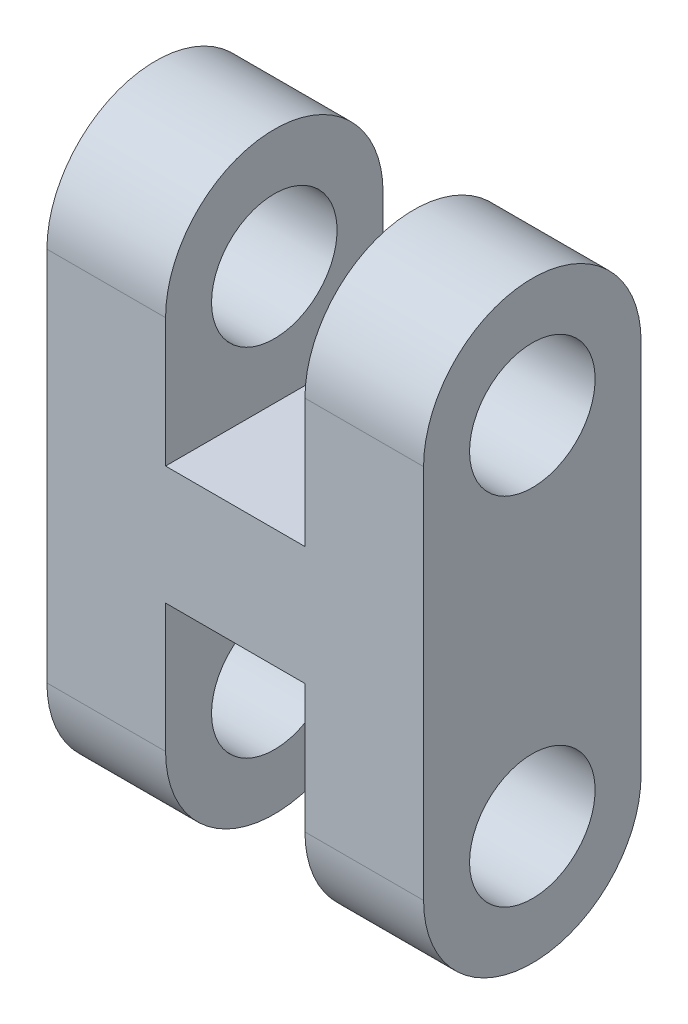
ISO-10303-21;
HEADER;
FILE_DESCRIPTION(('STEP AP214'),'2;1');
FILE_NAME('part.step','',(''),(''),'','','');
FILE_SCHEMA(('AUTOMOTIVE_DESIGN { 1 0 10303 214 1 1 1 1 }'));
ENDSEC;
DATA;
#1=APPLICATION_CONTEXT('core data for automotive mechanical design processes');
#2=APPLICATION_PROTOCOL_DEFINITION('international standard','automotive_design',2000,#1);
#3=PRODUCT_CONTEXT('',#1,'mechanical');
#4=PRODUCT('Part','Part','',(#3));
#5=PRODUCT_RELATED_PRODUCT_CATEGORY('part','',(#4));
#6=PRODUCT_DEFINITION_FORMATION('','',#4);
#7=PRODUCT_DEFINITION_CONTEXT('part definition',#1,'design');
#8=PRODUCT_DEFINITION('design','',#6,#7);
#9=PRODUCT_DEFINITION_SHAPE('','',#8);
#10=(LENGTH_UNIT() NAMED_UNIT(*) SI_UNIT(.MILLI.,.METRE.));
#11=(NAMED_UNIT(*) PLANE_ANGLE_UNIT() SI_UNIT($,.RADIAN.));
#12=(NAMED_UNIT(*) SI_UNIT($,.STERADIAN.) SOLID_ANGLE_UNIT());
#13=UNCERTAINTY_MEASURE_WITH_UNIT(LENGTH_MEASURE(1.E-05),#10,'distance_accuracy_value','');
#14=(GEOMETRIC_REPRESENTATION_CONTEXT(3) GLOBAL_UNCERTAINTY_ASSIGNED_CONTEXT((#13)) GLOBAL_UNIT_ASSIGNED_CONTEXT((#10,
#11,#12)) REPRESENTATION_CONTEXT('',''));
#15=CARTESIAN_POINT('',(0.,0.,0.));
#16=DIRECTION('',(0.,0.,1.));
#17=DIRECTION('',(1.,0.,0.));
#18=AXIS2_PLACEMENT_3D('',#15,#16,#17);
#19=CARTESIAN_POINT('',(6.525,0.,5.5));
#20=DIRECTION('',(-1.,0.,0.));
#21=DIRECTION('',(0.,0.,1.));
#22=AXIS2_PLACEMENT_3D('',#19,#20,#21);
#23=PLANE('',#22);
#24=CARTESIAN_POINT('',(6.525,12.,2.75));
#25=DIRECTION('',(-1.,0.,0.));
#26=DIRECTION('',(0.,0.,1.));
#27=AXIS2_PLACEMENT_3D('',#24,#25,#26);
#28=CIRCLE('',#27,1.5875);
#29=CARTESIAN_POINT('',(6.525,12.,4.3375));
#30=VERTEX_POINT('',#29);
#31=EDGE_CURVE('E248',#30,#30,#28,.F.);
#32=ORIENTED_EDGE('',*,*,#31,.F.);
#33=EDGE_LOOP('',(#32));
#34=FACE_BOUND('',#33,.T.);
#35=CARTESIAN_POINT('',(6.525,3.,2.75));
#36=DIRECTION('',(-1.,0.,0.));
#37=DIRECTION('',(0.,0.,1.));
#38=AXIS2_PLACEMENT_3D('',#35,#36,#37);
#39=CIRCLE('',#38,1.5875);
#40=CARTESIAN_POINT('',(6.525,3.,4.3375));
#41=VERTEX_POINT('',#40);
#42=EDGE_CURVE('E251',#41,#41,#39,.T.);
#43=ORIENTED_EDGE('',*,*,#42,.T.);
#44=EDGE_LOOP('',(#43));
#45=FACE_BOUND('',#44,.T.);
#46=CARTESIAN_POINT('',(6.525,2.75,2.75));
#47=DIRECTION('',(-1.,0.,0.));
#48=DIRECTION('',(0.,0.,1.));
#49=AXIS2_PLACEMENT_3D('',#46,#47,#48);
#50=CIRCLE('',#49,2.75);
#51=CARTESIAN_POINT('',(6.525,2.75,5.5));
#52=VERTEX_POINT('',#51);
#53=CARTESIAN_POINT('',(6.525,2.75,0.));
#54=VERTEX_POINT('',#53);
#55=EDGE_CURVE('E188',#52,#54,#50,.F.);
#56=ORIENTED_EDGE('',*,*,#55,.T.);
#57=DIRECTION('',(0.,1.,0.));
#58=VECTOR('',#57,1.);
#59=CARTESIAN_POINT('',(6.525,0.,0.));
#60=LINE('',#59,#58);
#61=CARTESIAN_POINT('',(6.525,12.25,0.));
#62=VERTEX_POINT('',#61);
#63=EDGE_CURVE('E115',#54,#62,#60,.T.);
#64=ORIENTED_EDGE('',*,*,#63,.T.);
#65=CARTESIAN_POINT('',(6.525,12.25,2.75));
#66=DIRECTION('',(-1.,0.,0.));
#67=DIRECTION('',(0.,0.,1.));
#68=AXIS2_PLACEMENT_3D('',#65,#66,#67);
#69=CIRCLE('',#68,2.75);
#70=CARTESIAN_POINT('',(6.525,12.25,5.5));
#71=VERTEX_POINT('',#70);
#72=EDGE_CURVE('E275',#62,#71,#69,.F.);
#73=ORIENTED_EDGE('',*,*,#72,.T.);
#74=DIRECTION('',(0.,1.,0.));
#75=VECTOR('',#74,1.);
#76=CARTESIAN_POINT('',(6.525,0.,5.5));
#77=LINE('',#76,#75);
#78=EDGE_CURVE('E190',#52,#71,#77,.T.);
#79=ORIENTED_EDGE('',*,*,#78,.F.);
#80=EDGE_LOOP('',(#56,#64,#73,#79));
#81=FACE_BOUND('',#80,.T.);
#82=ADVANCED_FACE('F100',(#34,#45,#81),#23,.F.);
#83=CARTESIAN_POINT('',(-3.,0.,5.5));
#84=DIRECTION('',(1.,0.,0.));
#85=DIRECTION('',(0.,1.,0.));
#86=AXIS2_PLACEMENT_3D('',#83,#84,#85);
#87=PLANE('',#86);
#88=CARTESIAN_POINT('',(-3.,12.,2.75));
#89=DIRECTION('',(-1.,0.,0.));
#90=DIRECTION('',(0.,0.,1.));
#91=AXIS2_PLACEMENT_3D('',#88,#89,#90);
#92=CIRCLE('',#91,1.5875);
#93=CARTESIAN_POINT('',(-3.,12.,4.3375));
#94=VERTEX_POINT('',#93);
#95=EDGE_CURVE('E262',#94,#94,#92,.T.);
#96=ORIENTED_EDGE('',*,*,#95,.F.);
#97=EDGE_LOOP('',(#96));
#98=FACE_BOUND('',#97,.T.);
#99=CARTESIAN_POINT('',(-3.,3.,2.75));
#100=DIRECTION('',(-1.,0.,0.));
#101=DIRECTION('',(0.,0.,1.));
#102=AXIS2_PLACEMENT_3D('',#99,#100,#101);
#103=CIRCLE('',#102,1.5875);
#104=CARTESIAN_POINT('',(-3.,3.,4.3375));
#105=VERTEX_POINT('',#104);
#106=EDGE_CURVE('E244',#105,#105,#103,.F.);
#107=ORIENTED_EDGE('',*,*,#106,.T.);
#108=EDGE_LOOP('',(#107));
#109=FACE_BOUND('',#108,.T.);
#110=DIRECTION('',(0.,-1.,0.));
#111=VECTOR('',#110,1.);
#112=CARTESIAN_POINT('',(-3.,0.,0.));
#113=LINE('',#112,#111);
#114=CARTESIAN_POINT('',(-3.,12.25,0.));
#115=VERTEX_POINT('',#114);
#116=CARTESIAN_POINT('',(-3.,2.75,0.));
#117=VERTEX_POINT('',#116);
#118=EDGE_CURVE('E222',#115,#117,#113,.T.);
#119=ORIENTED_EDGE('',*,*,#118,.T.);
#120=CARTESIAN_POINT('',(-3.,2.75,2.75));
#121=DIRECTION('',(-1.,0.,0.));
#122=DIRECTION('',(0.,0.,1.));
#123=AXIS2_PLACEMENT_3D('',#120,#121,#122);
#124=CIRCLE('',#123,2.75);
#125=CARTESIAN_POINT('',(-3.,2.75,5.5));
#126=VERTEX_POINT('',#125);
#127=EDGE_CURVE('E322',#117,#126,#124,.T.);
#128=ORIENTED_EDGE('',*,*,#127,.T.);
#129=DIRECTION('',(0.,-1.,0.));
#130=VECTOR('',#129,1.);
#131=CARTESIAN_POINT('',(-3.,0.,5.5));
#132=LINE('',#131,#130);
#133=CARTESIAN_POINT('',(-3.,12.25,5.5));
#134=VERTEX_POINT('',#133);
#135=EDGE_CURVE('E230',#134,#126,#132,.T.);
#136=ORIENTED_EDGE('',*,*,#135,.F.);
#137=CARTESIAN_POINT('',(-3.,12.25,2.75));
#138=DIRECTION('',(-1.,0.,0.));
#139=DIRECTION('',(0.,0.,1.));
#140=AXIS2_PLACEMENT_3D('',#137,#138,#139);
#141=CIRCLE('',#140,2.75);
#142=EDGE_CURVE('E274',#134,#115,#141,.T.);
#143=ORIENTED_EDGE('',*,*,#142,.T.);
#144=EDGE_LOOP('',(#119,#128,#136,#143));
#145=FACE_BOUND('',#144,.T.);
#146=ADVANCED_FACE('F320',(#98,#109,#145),#87,.F.);
#147=CARTESIAN_POINT('',(0.,0.,5.5));
#148=DIRECTION('',(-1.,0.,0.));
#149=DIRECTION('',(0.,0.,1.));
#150=AXIS2_PLACEMENT_3D('',#147,#148,#149);
#151=PLANE('',#150);
#152=CARTESIAN_POINT('',(0.,3.,2.75));
#153=DIRECTION('',(-1.,0.,0.));
#154=DIRECTION('',(0.,0.,1.));
#155=AXIS2_PLACEMENT_3D('',#152,#153,#154);
#156=CIRCLE('',#155,1.5875);
#157=CARTESIAN_POINT('',(0.,3.,4.3375));
#158=VERTEX_POINT('',#157);
#159=EDGE_CURVE('E243',#158,#158,#156,.F.);
#160=ORIENTED_EDGE('',*,*,#159,.F.);
#161=EDGE_LOOP('',(#160));
#162=FACE_BOUND('',#161,.T.);
#163=CARTESIAN_POINT('',(0.,2.75,2.75));
#164=DIRECTION('',(-1.,0.,0.));
#165=DIRECTION('',(0.,0.,1.));
#166=AXIS2_PLACEMENT_3D('',#163,#164,#165);
#167=CIRCLE('',#166,2.75);
#168=CARTESIAN_POINT('',(0.,2.75,0.));
#169=VERTEX_POINT('',#168);
#170=CARTESIAN_POINT('',(0.,2.75,5.5));
#171=VERTEX_POINT('',#170);
#172=EDGE_CURVE('E256',#169,#171,#167,.T.);
#173=ORIENTED_EDGE('',*,*,#172,.F.);
#174=DIRECTION('',(0.,1.,0.));
#175=VECTOR('',#174,1.);
#176=CARTESIAN_POINT('',(0.,0.,0.));
#177=LINE('',#176,#175);
#178=CARTESIAN_POINT('',(0.,6.,0.));
#179=VERTEX_POINT('',#178);
#180=EDGE_CURVE('E283',#169,#179,#177,.T.);
#181=ORIENTED_EDGE('',*,*,#180,.T.);
#182=DIRECTION('',(0.,0.,-1.));
#183=VECTOR('',#182,1.);
#184=CARTESIAN_POINT('',(0.,6.,5.5));
#185=LINE('',#184,#183);
#186=CARTESIAN_POINT('',(0.,6.,5.5));
#187=VERTEX_POINT('',#186);
#188=EDGE_CURVE('E236',#187,#179,#185,.T.);
#189=ORIENTED_EDGE('',*,*,#188,.F.);
#190=DIRECTION('',(0.,1.,0.));
#191=VECTOR('',#190,1.);
#192=CARTESIAN_POINT('',(0.,0.,5.5));
#193=LINE('',#192,#191);
#194=EDGE_CURVE('E225',#171,#187,#193,.T.);
#195=ORIENTED_EDGE('',*,*,#194,.F.);
#196=EDGE_LOOP('',(#173,#181,#189,#195));
#197=FACE_BOUND('',#196,.T.);
#198=ADVANCED_FACE('F102',(#162,#197),#151,.F.);
#199=CARTESIAN_POINT('',(3.525,0.,5.5));
#200=DIRECTION('',(1.,0.,0.));
#201=DIRECTION('',(0.,0.,-1.));
#202=AXIS2_PLACEMENT_3D('',#199,#200,#201);
#203=PLANE('',#202);
#204=CARTESIAN_POINT('',(3.525,3.,2.75));
#205=DIRECTION('',(1.,0.,0.));
#206=DIRECTION('',(0.,0.,-1.));
#207=AXIS2_PLACEMENT_3D('',#204,#205,#206);
#208=CIRCLE('',#207,1.5875);
#209=CARTESIAN_POINT('',(3.525,3.,1.1625));
#210=VERTEX_POINT('',#209);
#211=EDGE_CURVE('E241',#210,#210,#208,.F.);
#212=ORIENTED_EDGE('',*,*,#211,.F.);
#213=EDGE_LOOP('',(#212));
#214=FACE_BOUND('',#213,.T.);
#215=DIRECTION('',(0.,-1.,0.));
#216=VECTOR('',#215,1.);
#217=CARTESIAN_POINT('',(3.525,0.,0.));
#218=LINE('',#217,#216);
#219=CARTESIAN_POINT('',(3.525,6.,0.));
#220=VERTEX_POINT('',#219);
#221=CARTESIAN_POINT('',(3.525,2.75,0.));
#222=VERTEX_POINT('',#221);
#223=EDGE_CURVE('E210',#220,#222,#218,.T.);
#224=ORIENTED_EDGE('',*,*,#223,.T.);
#225=CARTESIAN_POINT('',(3.525,2.75,2.75));
#226=DIRECTION('',(1.,0.,0.));
#227=DIRECTION('',(0.,0.,-1.));
#228=AXIS2_PLACEMENT_3D('',#225,#226,#227);
#229=CIRCLE('',#228,2.75);
#230=CARTESIAN_POINT('',(3.525,2.75,5.5));
#231=VERTEX_POINT('',#230);
#232=EDGE_CURVE('E199',#231,#222,#229,.T.);
#233=ORIENTED_EDGE('',*,*,#232,.F.);
#234=DIRECTION('',(0.,-1.,0.));
#235=VECTOR('',#234,1.);
#236=CARTESIAN_POINT('',(3.525,0.,5.5));
#237=LINE('',#236,#235);
#238=CARTESIAN_POINT('',(3.525,6.,5.5));
#239=VERTEX_POINT('',#238);
#240=EDGE_CURVE('E287',#239,#231,#237,.T.);
#241=ORIENTED_EDGE('',*,*,#240,.F.);
#242=DIRECTION('',(0.,0.,-1.));
#243=VECTOR('',#242,1.);
#244=CARTESIAN_POINT('',(3.525,6.,5.5));
#245=LINE('',#244,#243);
#246=EDGE_CURVE('E233',#239,#220,#245,.T.);
#247=ORIENTED_EDGE('',*,*,#246,.T.);
#248=EDGE_LOOP('',(#224,#233,#241,#247));
#249=FACE_BOUND('',#248,.T.);
#250=ADVANCED_FACE('F309',(#214,#249),#203,.F.);
#251=CARTESIAN_POINT('',(0.,0.,5.5));
#252=DIRECTION('',(0.,0.,-1.));
#253=DIRECTION('',(-1.,0.,0.));
#254=AXIS2_PLACEMENT_3D('',#251,#252,#253);
#255=PLANE('',#254);
#256=DIRECTION('',(-1.,0.,0.));
#257=VECTOR('',#256,1.);
#258=CARTESIAN_POINT('',(11.0151280605346,2.75,5.5));
#259=LINE('',#258,#257);
#260=EDGE_CURVE('E312',#52,#231,#259,.T.);
#261=ORIENTED_EDGE('',*,*,#260,.F.);
#262=ORIENTED_EDGE('',*,*,#78,.T.);
#263=DIRECTION('',(-1.,0.,0.));
#264=VECTOR('',#263,1.);
#265=CARTESIAN_POINT('',(11.0151280605346,12.25,5.5));
#266=LINE('',#265,#264);
#267=CARTESIAN_POINT('',(3.525,12.25,5.5));
#268=VERTEX_POINT('',#267);
#269=EDGE_CURVE('E271',#71,#268,#266,.T.);
#270=ORIENTED_EDGE('',*,*,#269,.T.);
#271=DIRECTION('',(0.,-1.,0.));
#272=VECTOR('',#271,1.);
#273=CARTESIAN_POINT('',(3.525,9.,5.5));
#274=LINE('',#273,#272);
#275=CARTESIAN_POINT('',(3.525,9.,5.5));
#276=VERTEX_POINT('',#275);
#277=EDGE_CURVE('E291',#268,#276,#274,.T.);
#278=ORIENTED_EDGE('',*,*,#277,.T.);
#279=DIRECTION('',(-1.,0.,0.));
#280=VECTOR('',#279,1.);
#281=CARTESIAN_POINT('',(0.,9.,5.5));
#282=LINE('',#281,#280);
#283=CARTESIAN_POINT('',(0.,9.,5.5));
#284=VERTEX_POINT('',#283);
#285=EDGE_CURVE('E293',#276,#284,#282,.T.);
#286=ORIENTED_EDGE('',*,*,#285,.T.);
#287=DIRECTION('',(0.,1.,0.));
#288=VECTOR('',#287,1.);
#289=CARTESIAN_POINT('',(0.,15.,5.5));
#290=LINE('',#289,#288);
#291=CARTESIAN_POINT('',(0.,12.25,5.5));
#292=VERTEX_POINT('',#291);
#293=EDGE_CURVE('E295',#284,#292,#290,.T.);
#294=ORIENTED_EDGE('',*,*,#293,.T.);
#295=DIRECTION('',(-1.,0.,0.));
#296=VECTOR('',#295,1.);
#297=CARTESIAN_POINT('',(11.0151280605346,12.25,5.5));
#298=LINE('',#297,#296);
#299=EDGE_CURVE('E108',#134,#292,#298,.F.);
#300=ORIENTED_EDGE('',*,*,#299,.F.);
#301=ORIENTED_EDGE('',*,*,#135,.T.);
#302=EDGE_CURVE('E193',#171,#126,#259,.T.);
#303=ORIENTED_EDGE('',*,*,#302,.F.);
#304=ORIENTED_EDGE('',*,*,#194,.T.);
#305=DIRECTION('',(1.,0.,0.));
#306=VECTOR('',#305,1.);
#307=CARTESIAN_POINT('',(0.,6.,5.5));
#308=LINE('',#307,#306);
#309=EDGE_CURVE('E285',#187,#239,#308,.T.);
#310=ORIENTED_EDGE('',*,*,#309,.T.);
#311=ORIENTED_EDGE('',*,*,#240,.T.);
#312=EDGE_LOOP('',(#261,#262,#270,#278,#286,#294,#300,#301,#303,#304,#310,#311));
#313=FACE_BOUND('',#312,.T.);
#314=ADVANCED_FACE('F311',(#313),#255,.F.);
#315=CARTESIAN_POINT('',(3.525,9.,5.5));
#316=DIRECTION('',(1.,0.,0.));
#317=DIRECTION('',(0.,0.,-1.));
#318=AXIS2_PLACEMENT_3D('',#315,#316,#317);
#319=PLANE('',#318);
#320=CARTESIAN_POINT('',(3.525,12.,2.75));
#321=DIRECTION('',(1.,0.,0.));
#322=DIRECTION('',(0.,0.,-1.));
#323=AXIS2_PLACEMENT_3D('',#320,#321,#322);
#324=CIRCLE('',#323,1.5875);
#325=CARTESIAN_POINT('',(3.525,12.,1.1625));
#326=VERTEX_POINT('',#325);
#327=EDGE_CURVE('E268',#326,#326,#324,.T.);
#328=ORIENTED_EDGE('',*,*,#327,.T.);
#329=EDGE_LOOP('',(#328));
#330=FACE_BOUND('',#329,.T.);
#331=ORIENTED_EDGE('',*,*,#277,.F.);
#332=CARTESIAN_POINT('',(3.525,12.25,2.75));
#333=DIRECTION('',(1.,0.,0.));
#334=DIRECTION('',(0.,0.,-1.));
#335=AXIS2_PLACEMENT_3D('',#332,#333,#334);
#336=CIRCLE('',#335,2.75);
#337=CARTESIAN_POINT('',(3.525,12.25,0.));
#338=VERTEX_POINT('',#337);
#339=EDGE_CURVE('E281',#338,#268,#336,.T.);
#340=ORIENTED_EDGE('',*,*,#339,.F.);
#341=DIRECTION('',(0.,-1.,0.));
#342=VECTOR('',#341,1.);
#343=CARTESIAN_POINT('',(3.525,9.,0.));
#344=LINE('',#343,#342);
#345=CARTESIAN_POINT('',(3.525,9.,0.));
#346=VERTEX_POINT('',#345);
#347=EDGE_CURVE('E209',#338,#346,#344,.T.);
#348=ORIENTED_EDGE('',*,*,#347,.T.);
#349=DIRECTION('',(0.,0.,-1.));
#350=VECTOR('',#349,1.);
#351=CARTESIAN_POINT('',(3.525,9.,5.5));
#352=LINE('',#351,#350);
#353=EDGE_CURVE('E229',#276,#346,#352,.T.);
#354=ORIENTED_EDGE('',*,*,#353,.F.);
#355=EDGE_LOOP('',(#331,#340,#348,#354));
#356=FACE_BOUND('',#355,.T.);
#357=ADVANCED_FACE('F337',(#330,#356),#319,.F.);
#358=CARTESIAN_POINT('',(0.,15.,5.5));
#359=DIRECTION('',(-1.,0.,0.));
#360=DIRECTION('',(0.,0.,1.));
#361=AXIS2_PLACEMENT_3D('',#358,#359,#360);
#362=PLANE('',#361);
#363=CARTESIAN_POINT('',(0.,12.,2.75));
#364=DIRECTION('',(-1.,0.,0.));
#365=DIRECTION('',(0.,0.,1.));
#366=AXIS2_PLACEMENT_3D('',#363,#364,#365);
#367=CIRCLE('',#366,1.5875);
#368=CARTESIAN_POINT('',(0.,12.,4.3375));
#369=VERTEX_POINT('',#368);
#370=EDGE_CURVE('E265',#369,#369,#367,.T.);
#371=ORIENTED_EDGE('',*,*,#370,.T.);
#372=EDGE_LOOP('',(#371));
#373=FACE_BOUND('',#372,.T.);
#374=CARTESIAN_POINT('',(0.,12.25,2.75));
#375=DIRECTION('',(-1.,0.,0.));
#376=DIRECTION('',(0.,0.,1.));
#377=AXIS2_PLACEMENT_3D('',#374,#375,#376);
#378=CIRCLE('',#377,2.75);
#379=CARTESIAN_POINT('',(0.,12.25,0.));
#380=VERTEX_POINT('',#379);
#381=EDGE_CURVE('E123',#292,#380,#378,.T.);
#382=ORIENTED_EDGE('',*,*,#381,.F.);
#383=ORIENTED_EDGE('',*,*,#293,.F.);
#384=DIRECTION('',(0.,0.,-1.));
#385=VECTOR('',#384,1.);
#386=CARTESIAN_POINT('',(0.,9.,5.5));
#387=LINE('',#386,#385);
#388=CARTESIAN_POINT('',(0.,9.,0.));
#389=VERTEX_POINT('',#388);
#390=EDGE_CURVE('E226',#284,#389,#387,.T.);
#391=ORIENTED_EDGE('',*,*,#390,.T.);
#392=DIRECTION('',(0.,1.,0.));
#393=VECTOR('',#392,1.);
#394=CARTESIAN_POINT('',(0.,15.,0.));
#395=LINE('',#394,#393);
#396=EDGE_CURVE('E219',#389,#380,#395,.T.);
#397=ORIENTED_EDGE('',*,*,#396,.T.);
#398=EDGE_LOOP('',(#382,#383,#391,#397));
#399=FACE_BOUND('',#398,.T.);
#400=ADVANCED_FACE('F329',(#373,#399),#362,.F.);
#401=CARTESIAN_POINT('',(0.,6.,5.5));
#402=DIRECTION('',(0.,1.,0.));
#403=DIRECTION('',(0.,0.,1.));
#404=AXIS2_PLACEMENT_3D('',#401,#402,#403);
#405=PLANE('',#404);
#406=DIRECTION('',(1.,0.,0.));
#407=VECTOR('',#406,1.);
#408=CARTESIAN_POINT('',(0.,6.,0.));
#409=LINE('',#408,#407);
#410=EDGE_CURVE('E214',#179,#220,#409,.T.);
#411=ORIENTED_EDGE('',*,*,#410,.T.);
#412=ORIENTED_EDGE('',*,*,#246,.F.);
#413=ORIENTED_EDGE('',*,*,#309,.F.);
#414=ORIENTED_EDGE('',*,*,#188,.T.);
#415=EDGE_LOOP('',(#411,#412,#413,#414));
#416=FACE_BOUND('',#415,.T.);
#417=ADVANCED_FACE('F303',(#416),#405,.F.);
#418=CARTESIAN_POINT('',(0.,9.,5.5));
#419=DIRECTION('',(0.,-1.,0.));
#420=DIRECTION('',(0.,0.,-1.));
#421=AXIS2_PLACEMENT_3D('',#418,#419,#420);
#422=PLANE('',#421);
#423=DIRECTION('',(-1.,0.,0.));
#424=VECTOR('',#423,1.);
#425=CARTESIAN_POINT('',(0.,9.,0.));
#426=LINE('',#425,#424);
#427=EDGE_CURVE('E212',#346,#389,#426,.T.);
#428=ORIENTED_EDGE('',*,*,#427,.T.);
#429=ORIENTED_EDGE('',*,*,#390,.F.);
#430=ORIENTED_EDGE('',*,*,#285,.F.);
#431=ORIENTED_EDGE('',*,*,#353,.T.);
#432=EDGE_LOOP('',(#428,#429,#430,#431));
#433=FACE_BOUND('',#432,.T.);
#434=ADVANCED_FACE('F333',(#433),#422,.F.);
#435=CARTESIAN_POINT('',(0.,0.,0.));
#436=DIRECTION('',(0.,0.,-1.));
#437=DIRECTION('',(-1.,0.,0.));
#438=AXIS2_PLACEMENT_3D('',#435,#436,#437);
#439=PLANE('',#438);
#440=DIRECTION('',(-1.,0.,0.));
#441=VECTOR('',#440,1.);
#442=CARTESIAN_POINT('',(11.0151280605346,2.75,0.));
#443=LINE('',#442,#441);
#444=EDGE_CURVE('E12',#117,#169,#443,.F.);
#445=ORIENTED_EDGE('',*,*,#444,.F.);
#446=ORIENTED_EDGE('',*,*,#118,.F.);
#447=DIRECTION('',(-1.,0.,0.));
#448=VECTOR('',#447,1.);
#449=CARTESIAN_POINT('',(11.0151280605346,12.25,0.));
#450=LINE('',#449,#448);
#451=EDGE_CURVE('E239',#380,#115,#450,.T.);
#452=ORIENTED_EDGE('',*,*,#451,.F.);
#453=ORIENTED_EDGE('',*,*,#396,.F.);
#454=ORIENTED_EDGE('',*,*,#427,.F.);
#455=ORIENTED_EDGE('',*,*,#347,.F.);
#456=DIRECTION('',(-1.,0.,0.));
#457=VECTOR('',#456,1.);
#458=CARTESIAN_POINT('',(11.0151280605346,12.25,0.));
#459=LINE('',#458,#457);
#460=EDGE_CURVE('E208',#62,#338,#459,.T.);
#461=ORIENTED_EDGE('',*,*,#460,.F.);
#462=ORIENTED_EDGE('',*,*,#63,.F.);
#463=DIRECTION('',(-1.,0.,0.));
#464=VECTOR('',#463,1.);
#465=CARTESIAN_POINT('',(11.0151280605346,2.75,0.));
#466=LINE('',#465,#464);
#467=EDGE_CURVE('E194',#54,#222,#466,.T.);
#468=ORIENTED_EDGE('',*,*,#467,.T.);
#469=ORIENTED_EDGE('',*,*,#223,.F.);
#470=ORIENTED_EDGE('',*,*,#410,.F.);
#471=ORIENTED_EDGE('',*,*,#180,.F.);
#472=EDGE_LOOP('',(#445,#446,#452,#453,#454,#455,#461,#462,#468,#469,#470,#471));
#473=FACE_BOUND('',#472,.T.);
#474=ADVANCED_FACE('F206',(#473),#439,.T.);
#475=CARTESIAN_POINT('',(11.0151280605346,12.25,2.75));
#476=DIRECTION('',(-1.,0.,0.));
#477=DIRECTION('',(0.,0.,1.));
#478=AXIS2_PLACEMENT_3D('',#475,#476,#477);
#479=CYLINDRICAL_SURFACE('',#478,2.75);
#480=ORIENTED_EDGE('',*,*,#381,.T.);
#481=ORIENTED_EDGE('',*,*,#451,.T.);
#482=ORIENTED_EDGE('',*,*,#142,.F.);
#483=ORIENTED_EDGE('',*,*,#299,.T.);
#484=EDGE_LOOP('',(#480,#481,#482,#483));
#485=FACE_BOUND('',#484,.T.);
#486=ADVANCED_FACE('F324',(#485),#479,.T.);
#487=ORIENTED_EDGE('',*,*,#339,.T.);
#488=ORIENTED_EDGE('',*,*,#269,.F.);
#489=ORIENTED_EDGE('',*,*,#72,.F.);
#490=ORIENTED_EDGE('',*,*,#460,.T.);
#491=EDGE_LOOP('',(#487,#488,#489,#490));
#492=FACE_BOUND('',#491,.T.);
#493=ADVANCED_FACE('F341',(#492),#479,.T.);
#494=CARTESIAN_POINT('',(11.0151280605346,12.,2.75));
#495=DIRECTION('',(-1.,0.,0.));
#496=DIRECTION('',(0.,0.,1.));
#497=AXIS2_PLACEMENT_3D('',#494,#495,#496);
#498=CYLINDRICAL_SURFACE('',#497,1.5875);
#499=ORIENTED_EDGE('',*,*,#95,.T.);
#500=EDGE_LOOP('',(#499));
#501=FACE_BOUND('',#500,.T.);
#502=ORIENTED_EDGE('',*,*,#370,.F.);
#503=EDGE_LOOP('',(#502));
#504=FACE_BOUND('',#503,.T.);
#505=ADVANCED_FACE('F343',(#501,#504),#498,.F.);
#506=ORIENTED_EDGE('',*,*,#31,.T.);
#507=EDGE_LOOP('',(#506));
#508=FACE_BOUND('',#507,.T.);
#509=ORIENTED_EDGE('',*,*,#327,.F.);
#510=EDGE_LOOP('',(#509));
#511=FACE_BOUND('',#510,.T.);
#512=ADVANCED_FACE('F349',(#508,#511),#498,.F.);
#513=CARTESIAN_POINT('',(11.0151280605346,3.,2.75));
#514=DIRECTION('',(-1.,0.,0.));
#515=DIRECTION('',(0.,0.,1.));
#516=AXIS2_PLACEMENT_3D('',#513,#514,#515);
#517=CYLINDRICAL_SURFACE('',#516,1.5875);
#518=ORIENTED_EDGE('',*,*,#42,.F.);
#519=EDGE_LOOP('',(#518));
#520=FACE_BOUND('',#519,.T.);
#521=ORIENTED_EDGE('',*,*,#211,.T.);
#522=EDGE_LOOP('',(#521));
#523=FACE_BOUND('',#522,.T.);
#524=ADVANCED_FACE('F432',(#520,#523),#517,.F.);
#525=ORIENTED_EDGE('',*,*,#106,.F.);
#526=EDGE_LOOP('',(#525));
#527=FACE_BOUND('',#526,.T.);
#528=ORIENTED_EDGE('',*,*,#159,.T.);
#529=EDGE_LOOP('',(#528));
#530=FACE_BOUND('',#529,.T.);
#531=ADVANCED_FACE('F441',(#527,#530),#517,.F.);
#532=CARTESIAN_POINT('',(11.0151280605346,2.75,2.75));
#533=DIRECTION('',(-1.,0.,0.));
#534=DIRECTION('',(0.,0.,1.));
#535=AXIS2_PLACEMENT_3D('',#532,#533,#534);
#536=CYLINDRICAL_SURFACE('',#535,2.75);
#537=ORIENTED_EDGE('',*,*,#172,.T.);
#538=ORIENTED_EDGE('',*,*,#302,.T.);
#539=ORIENTED_EDGE('',*,*,#127,.F.);
#540=ORIENTED_EDGE('',*,*,#444,.T.);
#541=EDGE_LOOP('',(#537,#538,#539,#540));
#542=FACE_BOUND('',#541,.T.);
#543=ADVANCED_FACE('F451',(#542),#536,.T.);
#544=ORIENTED_EDGE('',*,*,#232,.T.);
#545=ORIENTED_EDGE('',*,*,#467,.F.);
#546=ORIENTED_EDGE('',*,*,#55,.F.);
#547=ORIENTED_EDGE('',*,*,#260,.T.);
#548=EDGE_LOOP('',(#544,#545,#546,#547));
#549=FACE_BOUND('',#548,.T.);
#550=ADVANCED_FACE('F197',(#549),#536,.T.);
#551=CLOSED_SHELL('',(#82,#146,#198,#250,#314,#357,#400,#417,#434,#474,#486,#493,#505,#512,#524,
#531,#543,#550));
#552=MANIFOLD_SOLID_BREP('B2',#551);
#553=ADVANCED_BREP_SHAPE_REPRESENTATION('',(#18,#552),#14);
#554=SHAPE_DEFINITION_REPRESENTATION(#9,#553);
ENDSEC;
END-ISO-10303-21;
